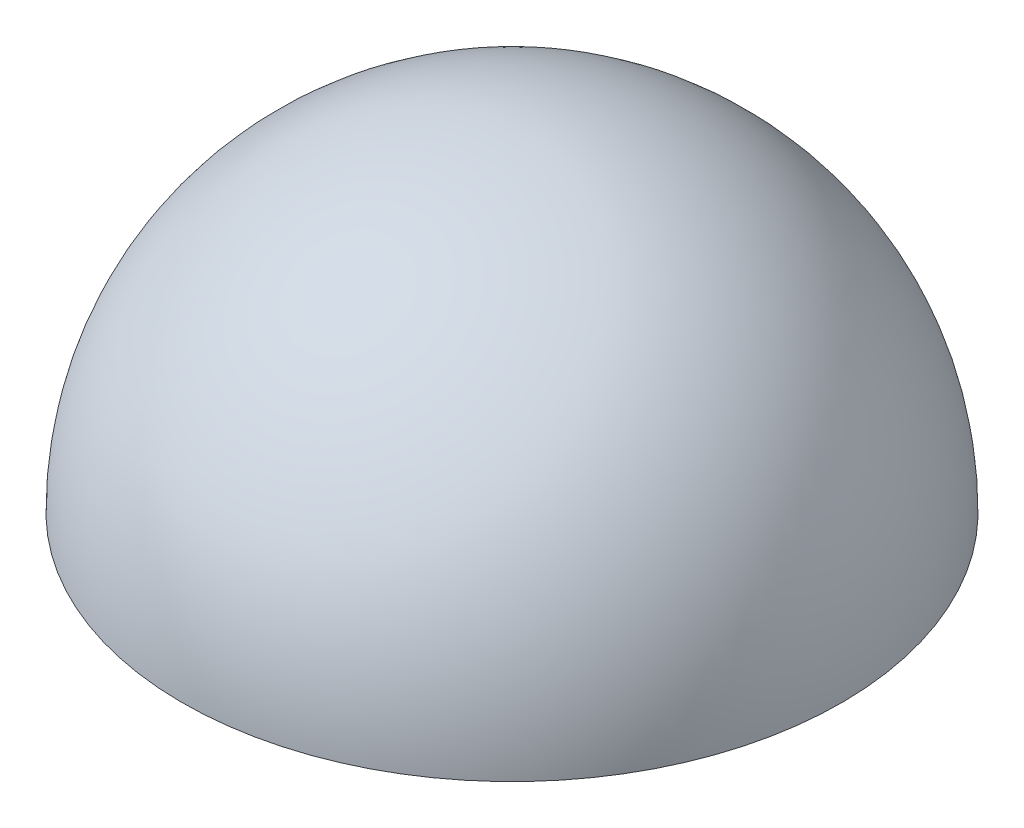
ISO-10303-21;
HEADER;
FILE_DESCRIPTION(('STEP AP214'),'2;1');
FILE_NAME('part.step','',(''),(''),'','','');
FILE_SCHEMA(('AUTOMOTIVE_DESIGN { 1 0 10303 214 1 1 1 1 }'));
ENDSEC;
DATA;
#1=APPLICATION_CONTEXT('core data for automotive mechanical design processes');
#2=APPLICATION_PROTOCOL_DEFINITION('international standard','automotive_design',2000,#1);
#3=PRODUCT_CONTEXT('',#1,'mechanical');
#4=PRODUCT('Part','Part','',(#3));
#5=PRODUCT_RELATED_PRODUCT_CATEGORY('part','',(#4));
#6=PRODUCT_DEFINITION_FORMATION('','',#4);
#7=PRODUCT_DEFINITION_CONTEXT('part definition',#1,'design');
#8=PRODUCT_DEFINITION('design','',#6,#7);
#9=PRODUCT_DEFINITION_SHAPE('','',#8);
#10=(LENGTH_UNIT() NAMED_UNIT(*) SI_UNIT(.MILLI.,.METRE.));
#11=(NAMED_UNIT(*) PLANE_ANGLE_UNIT() SI_UNIT($,.RADIAN.));
#12=(NAMED_UNIT(*) SI_UNIT($,.STERADIAN.) SOLID_ANGLE_UNIT());
#13=UNCERTAINTY_MEASURE_WITH_UNIT(LENGTH_MEASURE(1.E-05),#10,'distance_accuracy_value','');
#14=(GEOMETRIC_REPRESENTATION_CONTEXT(3) GLOBAL_UNCERTAINTY_ASSIGNED_CONTEXT((#13)) GLOBAL_UNIT_ASSIGNED_CONTEXT((#10,
#11,#12)) REPRESENTATION_CONTEXT('',''));
#15=CARTESIAN_POINT('',(0.,0.,0.));
#16=DIRECTION('',(0.,0.,1.));
#17=DIRECTION('',(1.,0.,0.));
#18=AXIS2_PLACEMENT_3D('',#15,#16,#17);
#19=CARTESIAN_POINT('',(-28.8326486478669,0.,-10.7490137503012));
#20=DIRECTION('',(0.0651324132910992,0.,0.997876630019401));
#21=DIRECTION('',(-0.997876630019401,0.,0.0651324132910992));
#22=AXIS2_PLACEMENT_3D('',#19,#20,#21);
#23=SPHERICAL_SURFACE('',#22,73.025);
#24=CARTESIAN_POINT('',(-28.8326486478669,0.,-10.7490137503012));
#25=DIRECTION('',(0.,-1.,0.));
#26=DIRECTION('',(0.129988226159906,0.,0.991515537477755));
#27=AXIS2_PLACEMENT_3D('',#24,#25,#26);
#28=SPHERICAL_SURFACE('',#27,73.025);
#29=CARTESIAN_POINT('',(-28.8326486478669,0.,-10.7490137503012));
#30=DIRECTION('',(0.,-1.,0.));
#31=DIRECTION('',(0.129988226159906,0.,0.991515537477756));
#32=AXIS2_PLACEMENT_3D('',#29,#30,#31);
#33=CIRCLE('',#32,73.025);
#34=CARTESIAN_POINT('',(-19.3402584325397,0.,61.6564083740119));
#35=VERTEX_POINT('',#34);
#36=EDGE_CURVE('E10',#35,#35,#33,.T.);
#37=ORIENTED_EDGE('',*,*,#36,.F.);
#38=EDGE_LOOP('',(#37));
#39=FACE_BOUND('',#38,.T.);
#40=ADVANCED_FACE('F34',(#39),#28,.T.);
#41=CARTESIAN_POINT('',(-56.0234225384938,1.96020959351931E-13,3.65670524891254));
#42=DIRECTION('',(0.,-1.,0.));
#43=DIRECTION('',(0.129988226159906,0.,0.991515537477756));
#44=AXIS2_PLACEMENT_3D('',#41,#42,#43);
#45=PLANE('',#44);
#46=ORIENTED_EDGE('',*,*,#36,.T.);
#47=EDGE_LOOP('',(#46));
#48=FACE_BOUND('',#47,.T.);
#49=ADVANCED_FACE('F41',(#48),#45,.T.);
#50=CLOSED_SHELL('',(#40,#49));
#51=MANIFOLD_SOLID_BREP('B2',#50);
#52=ADVANCED_BREP_SHAPE_REPRESENTATION('',(#18,#51),#14);
#53=SHAPE_DEFINITION_REPRESENTATION(#9,#52);
ENDSEC;
END-ISO-10303-21;
